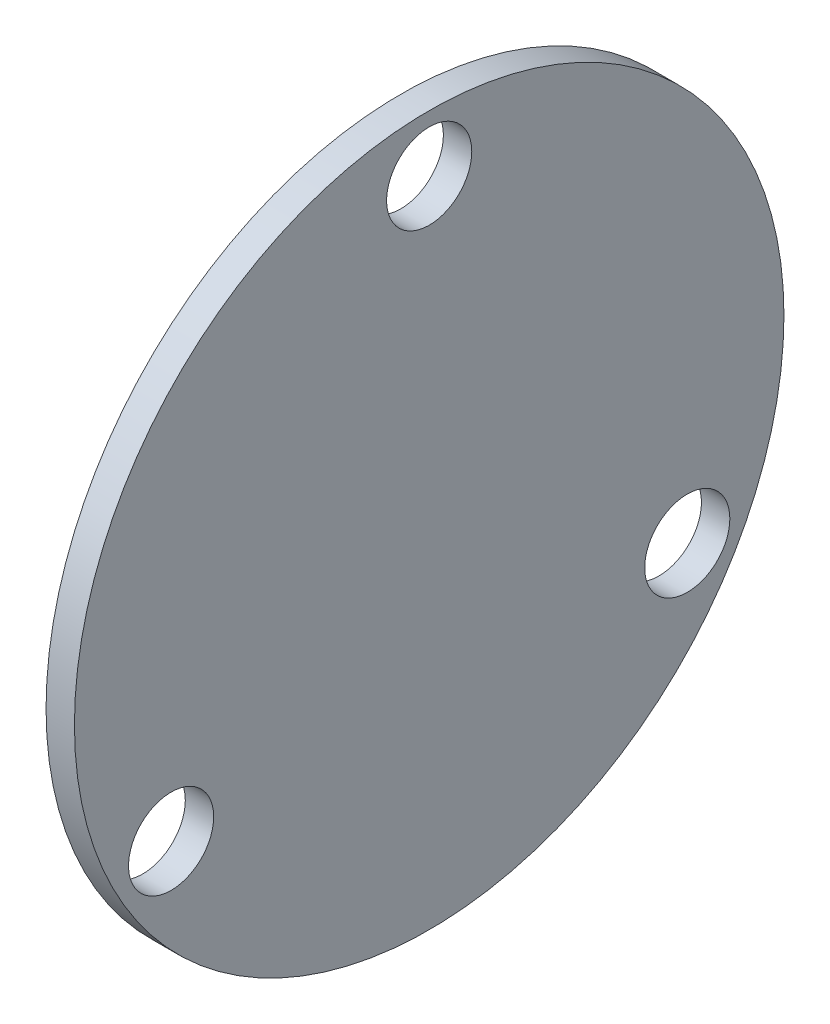
ISO-10303-21;
HEADER;
FILE_DESCRIPTION(('STEP AP214'),'2;1');
FILE_NAME('part.step','',(''),(''),'','','');
FILE_SCHEMA(('AUTOMOTIVE_DESIGN { 1 0 10303 214 1 1 1 1 }'));
ENDSEC;
DATA;
#1=APPLICATION_CONTEXT('core data for automotive mechanical design processes');
#2=APPLICATION_PROTOCOL_DEFINITION('international standard','automotive_design',2000,#1);
#3=PRODUCT_CONTEXT('',#1,'mechanical');
#4=PRODUCT('Part','Part','',(#3));
#5=PRODUCT_RELATED_PRODUCT_CATEGORY('part','',(#4));
#6=PRODUCT_DEFINITION_FORMATION('','',#4);
#7=PRODUCT_DEFINITION_CONTEXT('part definition',#1,'design');
#8=PRODUCT_DEFINITION('design','',#6,#7);
#9=PRODUCT_DEFINITION_SHAPE('','',#8);
#10=(LENGTH_UNIT() NAMED_UNIT(*) SI_UNIT(.MILLI.,.METRE.));
#11=(NAMED_UNIT(*) PLANE_ANGLE_UNIT() SI_UNIT($,.RADIAN.));
#12=(NAMED_UNIT(*) SI_UNIT($,.STERADIAN.) SOLID_ANGLE_UNIT());
#13=UNCERTAINTY_MEASURE_WITH_UNIT(LENGTH_MEASURE(1.E-05),#10,'distance_accuracy_value','');
#14=(GEOMETRIC_REPRESENTATION_CONTEXT(3) GLOBAL_UNCERTAINTY_ASSIGNED_CONTEXT((#13)) GLOBAL_UNIT_ASSIGNED_CONTEXT((#10,
#11,#12)) REPRESENTATION_CONTEXT('',''));
#15=CARTESIAN_POINT('',(0.,0.,0.));
#16=DIRECTION('',(0.,0.,1.));
#17=DIRECTION('',(1.,0.,0.));
#18=AXIS2_PLACEMENT_3D('',#15,#16,#17);
#19=CARTESIAN_POINT('',(1.,0.,0.));
#20=DIRECTION('',(-1.,0.,0.));
#21=DIRECTION('',(0.,0.,1.));
#22=AXIS2_PLACEMENT_3D('',#19,#20,#21);
#23=CYLINDRICAL_SURFACE('',#22,12.5);
#24=CARTESIAN_POINT('',(1.,0.,0.));
#25=DIRECTION('',(1.,0.,0.));
#26=DIRECTION('',(0.,0.,-1.));
#27=AXIS2_PLACEMENT_3D('',#24,#25,#26);
#28=CIRCLE('',#27,12.5);
#29=CARTESIAN_POINT('',(1.,0.,-12.5));
#30=VERTEX_POINT('',#29);
#31=EDGE_CURVE('E10',#30,#30,#28,.T.);
#32=ORIENTED_EDGE('',*,*,#31,.F.);
#33=EDGE_LOOP('',(#32));
#34=FACE_BOUND('',#33,.T.);
#35=CARTESIAN_POINT('',(0.,0.,0.));
#36=DIRECTION('',(1.,0.,0.));
#37=DIRECTION('',(0.,0.,-1.));
#38=AXIS2_PLACEMENT_3D('',#35,#36,#37);
#39=CIRCLE('',#38,12.5);
#40=CARTESIAN_POINT('',(0.,0.,-12.5));
#41=VERTEX_POINT('',#40);
#42=EDGE_CURVE('E34',#41,#41,#39,.T.);
#43=ORIENTED_EDGE('',*,*,#42,.T.);
#44=EDGE_LOOP('',(#43));
#45=FACE_BOUND('',#44,.T.);
#46=ADVANCED_FACE('F31',(#34,#45),#23,.T.);
#47=CARTESIAN_POINT('',(1.,0.,0.));
#48=DIRECTION('',(1.,0.,0.));
#49=DIRECTION('',(0.,0.,-1.));
#50=AXIS2_PLACEMENT_3D('',#47,#48,#49);
#51=PLANE('',#50);
#52=CARTESIAN_POINT('',(1.,-5.25000000000039,9.09326673973594));
#53=DIRECTION('',(1.,0.,0.));
#54=DIRECTION('',(0.,0.,-1.));
#55=AXIS2_PLACEMENT_3D('',#52,#53,#54);
#56=CIRCLE('',#55,1.50000000000085);
#57=CARTESIAN_POINT('',(1.,-5.25000000000039,7.59326673973509));
#58=VERTEX_POINT('',#57);
#59=EDGE_CURVE('E55',#58,#58,#56,.T.);
#60=ORIENTED_EDGE('',*,*,#59,.F.);
#61=EDGE_LOOP('',(#60));
#62=FACE_BOUND('',#61,.T.);
#63=CARTESIAN_POINT('',(1.,-5.24999999999961,-9.09326673973728));
#64=DIRECTION('',(1.,0.,0.));
#65=DIRECTION('',(0.,0.,-1.));
#66=AXIS2_PLACEMENT_3D('',#63,#64,#65);
#67=CIRCLE('',#66,1.50000000000058);
#68=CARTESIAN_POINT('',(1.,-5.24999999999961,-10.5932667397379));
#69=VERTEX_POINT('',#68);
#70=EDGE_CURVE('E49',#69,#69,#67,.T.);
#71=ORIENTED_EDGE('',*,*,#70,.F.);
#72=EDGE_LOOP('',(#71));
#73=FACE_BOUND('',#72,.T.);
#74=CARTESIAN_POINT('',(1.,10.5,0.));
#75=DIRECTION('',(1.,0.,0.));
#76=DIRECTION('',(0.,0.,-1.));
#77=AXIS2_PLACEMENT_3D('',#74,#75,#76);
#78=CIRCLE('',#77,1.5);
#79=CARTESIAN_POINT('',(1.,10.5,-1.5));
#80=VERTEX_POINT('',#79);
#81=EDGE_CURVE('E43',#80,#80,#78,.T.);
#82=ORIENTED_EDGE('',*,*,#81,.F.);
#83=EDGE_LOOP('',(#82));
#84=FACE_BOUND('',#83,.T.);
#85=ORIENTED_EDGE('',*,*,#31,.T.);
#86=EDGE_LOOP('',(#85));
#87=FACE_BOUND('',#86,.T.);
#88=ADVANCED_FACE('F71',(#62,#73,#84,#87),#51,.T.);
#89=CARTESIAN_POINT('',(0.,0.,0.));
#90=DIRECTION('',(1.,0.,0.));
#91=DIRECTION('',(0.,0.,-1.));
#92=AXIS2_PLACEMENT_3D('',#89,#90,#91);
#93=PLANE('',#92);
#94=CARTESIAN_POINT('',(0.,-5.25000000000039,9.09326673973594));
#95=DIRECTION('',(1.,0.,0.));
#96=DIRECTION('',(0.,0.,-1.));
#97=AXIS2_PLACEMENT_3D('',#94,#95,#96);
#98=CIRCLE('',#97,1.50000000000085);
#99=CARTESIAN_POINT('',(0.,-5.25000000000039,7.59326673973509));
#100=VERTEX_POINT('',#99);
#101=EDGE_CURVE('E52',#100,#100,#98,.T.);
#102=ORIENTED_EDGE('',*,*,#101,.T.);
#103=EDGE_LOOP('',(#102));
#104=FACE_BOUND('',#103,.T.);
#105=CARTESIAN_POINT('',(0.,-5.24999999999961,-9.09326673973728));
#106=DIRECTION('',(1.,0.,0.));
#107=DIRECTION('',(0.,0.,-1.));
#108=AXIS2_PLACEMENT_3D('',#105,#106,#107);
#109=CIRCLE('',#108,1.50000000000058);
#110=CARTESIAN_POINT('',(0.,-5.24999999999961,-10.5932667397379));
#111=VERTEX_POINT('',#110);
#112=EDGE_CURVE('E46',#111,#111,#109,.T.);
#113=ORIENTED_EDGE('',*,*,#112,.T.);
#114=EDGE_LOOP('',(#113));
#115=FACE_BOUND('',#114,.T.);
#116=CARTESIAN_POINT('',(0.,10.5,0.));
#117=DIRECTION('',(1.,0.,0.));
#118=DIRECTION('',(0.,0.,-1.));
#119=AXIS2_PLACEMENT_3D('',#116,#117,#118);
#120=CIRCLE('',#119,1.5);
#121=CARTESIAN_POINT('',(0.,10.5,-1.5));
#122=VERTEX_POINT('',#121);
#123=EDGE_CURVE('E41',#122,#122,#120,.T.);
#124=ORIENTED_EDGE('',*,*,#123,.T.);
#125=EDGE_LOOP('',(#124));
#126=FACE_BOUND('',#125,.T.);
#127=ORIENTED_EDGE('',*,*,#42,.F.);
#128=EDGE_LOOP('',(#127));
#129=FACE_BOUND('',#128,.T.);
#130=ADVANCED_FACE('F61',(#104,#115,#126,#129),#93,.F.);
#131=CARTESIAN_POINT('',(0.,10.5,0.));
#132=DIRECTION('',(1.,0.,0.));
#133=DIRECTION('',(0.,0.,-1.));
#134=AXIS2_PLACEMENT_3D('',#131,#132,#133);
#135=CYLINDRICAL_SURFACE('',#134,1.5);
#136=ORIENTED_EDGE('',*,*,#123,.F.);
#137=EDGE_LOOP('',(#136));
#138=FACE_BOUND('',#137,.T.);
#139=ORIENTED_EDGE('',*,*,#81,.T.);
#140=EDGE_LOOP('',(#139));
#141=FACE_BOUND('',#140,.T.);
#142=ADVANCED_FACE('F79',(#138,#141),#135,.F.);
#143=CARTESIAN_POINT('',(0.,-5.24999999999961,-9.09326673973728));
#144=DIRECTION('',(1.,0.,0.));
#145=DIRECTION('',(0.,0.,-1.));
#146=AXIS2_PLACEMENT_3D('',#143,#144,#145);
#147=CYLINDRICAL_SURFACE('',#146,1.50000000000058);
#148=ORIENTED_EDGE('',*,*,#112,.F.);
#149=EDGE_LOOP('',(#148));
#150=FACE_BOUND('',#149,.T.);
#151=ORIENTED_EDGE('',*,*,#70,.T.);
#152=EDGE_LOOP('',(#151));
#153=FACE_BOUND('',#152,.T.);
#154=ADVANCED_FACE('F67',(#150,#153),#147,.F.);
#155=CARTESIAN_POINT('',(0.,-5.25000000000039,9.09326673973594));
#156=DIRECTION('',(1.,0.,0.));
#157=DIRECTION('',(0.,0.,-1.));
#158=AXIS2_PLACEMENT_3D('',#155,#156,#157);
#159=CYLINDRICAL_SURFACE('',#158,1.50000000000085);
#160=ORIENTED_EDGE('',*,*,#101,.F.);
#161=EDGE_LOOP('',(#160));
#162=FACE_BOUND('',#161,.T.);
#163=ORIENTED_EDGE('',*,*,#59,.T.);
#164=EDGE_LOOP('',(#163));
#165=FACE_BOUND('',#164,.T.);
#166=ADVANCED_FACE('F64',(#162,#165),#159,.F.);
#167=CLOSED_SHELL('',(#46,#88,#130,#142,#154,#166));
#168=MANIFOLD_SOLID_BREP('B2',#167);
#169=ADVANCED_BREP_SHAPE_REPRESENTATION('',(#18,#168),#14);
#170=SHAPE_DEFINITION_REPRESENTATION(#9,#169);
ENDSEC;
END-ISO-10303-21;
